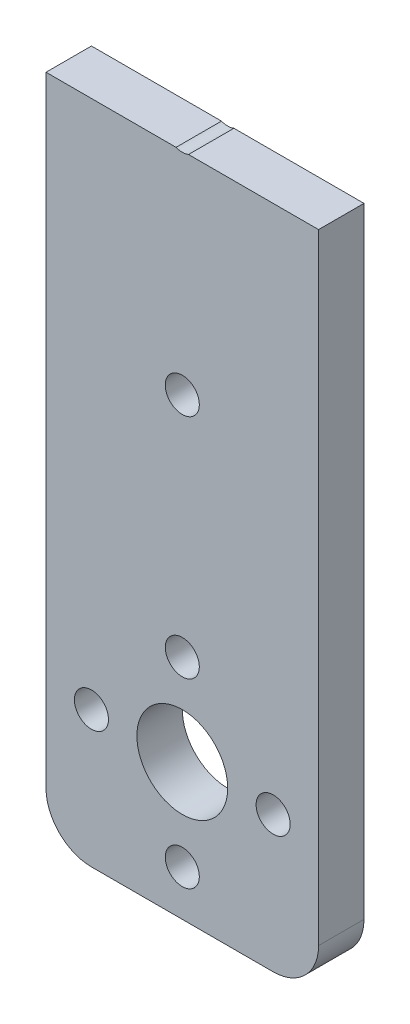
ISO-10303-21;
HEADER;
FILE_DESCRIPTION(('STEP AP214'),'2;1');
FILE_NAME('part.step','',(''),(''),'','','');
FILE_SCHEMA(('AUTOMOTIVE_DESIGN { 1 0 10303 214 1 1 1 1 }'));
ENDSEC;
DATA;
#1=APPLICATION_CONTEXT('core data for automotive mechanical design processes');
#2=APPLICATION_PROTOCOL_DEFINITION('international standard','automotive_design',2000,#1);
#3=PRODUCT_CONTEXT('',#1,'mechanical');
#4=PRODUCT('Part','Part','',(#3));
#5=PRODUCT_RELATED_PRODUCT_CATEGORY('part','',(#4));
#6=PRODUCT_DEFINITION_FORMATION('','',#4);
#7=PRODUCT_DEFINITION_CONTEXT('part definition',#1,'design');
#8=PRODUCT_DEFINITION('design','',#6,#7);
#9=PRODUCT_DEFINITION_SHAPE('','',#8);
#10=(LENGTH_UNIT() NAMED_UNIT(*) SI_UNIT(.MILLI.,.METRE.));
#11=(NAMED_UNIT(*) PLANE_ANGLE_UNIT() SI_UNIT($,.RADIAN.));
#12=(NAMED_UNIT(*) SI_UNIT($,.STERADIAN.) SOLID_ANGLE_UNIT());
#13=UNCERTAINTY_MEASURE_WITH_UNIT(LENGTH_MEASURE(1.E-05),#10,'distance_accuracy_value','');
#14=(GEOMETRIC_REPRESENTATION_CONTEXT(3) GLOBAL_UNCERTAINTY_ASSIGNED_CONTEXT((#13)) GLOBAL_UNIT_ASSIGNED_CONTEXT((#10,
#11,#12)) REPRESENTATION_CONTEXT('',''));
#15=CARTESIAN_POINT('',(0.,0.,0.));
#16=DIRECTION('',(0.,0.,1.));
#17=DIRECTION('',(1.,0.,0.));
#18=AXIS2_PLACEMENT_3D('',#15,#16,#17);
#19=CARTESIAN_POINT('',(-57.2966754660947,34.9503189792664,4.));
#20=DIRECTION('',(1.,0.,0.));
#21=DIRECTION('',(0.,1.,0.));
#22=AXIS2_PLACEMENT_3D('',#19,#20,#21);
#23=PLANE('',#22);
#24=DIRECTION('',(0.,-1.,0.));
#25=VECTOR('',#24,1.);
#26=CARTESIAN_POINT('',(-57.2966754660947,34.9503189792664,4.));
#27=LINE('',#26,#25);
#28=CARTESIAN_POINT('',(-57.2966754660947,13.5536352225967,4.));
#29=VERTEX_POINT('',#28);
#30=CARTESIAN_POINT('',(-57.2966754660947,-41.0496810207336,4.));
#31=VERTEX_POINT('',#30);
#32=EDGE_CURVE('E109',#29,#31,#27,.T.);
#33=ORIENTED_EDGE('',*,*,#32,.F.);
#34=DIRECTION('',(0.,0.,1.));
#35=VECTOR('',#34,1.);
#36=CARTESIAN_POINT('',(-57.2966754660947,13.5536352225967,0.));
#37=LINE('',#36,#35);
#38=CARTESIAN_POINT('',(-57.2966754660947,13.5536352225967,0.));
#39=VERTEX_POINT('',#38);
#40=EDGE_CURVE('E98',#39,#29,#37,.T.);
#41=ORIENTED_EDGE('',*,*,#40,.F.);
#42=DIRECTION('',(0.,-1.,0.));
#43=VECTOR('',#42,1.);
#44=CARTESIAN_POINT('',(-57.2966754660947,34.9503189792664,0.));
#45=LINE('',#44,#43);
#46=CARTESIAN_POINT('',(-57.2966754660947,-41.0496810207336,0.));
#47=VERTEX_POINT('',#46);
#48=EDGE_CURVE('E107',#39,#47,#45,.T.);
#49=ORIENTED_EDGE('',*,*,#48,.T.);
#50=DIRECTION('',(0.,0.,-1.));
#51=VECTOR('',#50,1.);
#52=CARTESIAN_POINT('',(-57.2966754660947,-41.0496810207336,4.));
#53=LINE('',#52,#51);
#54=EDGE_CURVE('E135',#47,#31,#53,.F.);
#55=ORIENTED_EDGE('',*,*,#54,.T.);
#56=EDGE_LOOP('',(#33,#41,#49,#55));
#57=FACE_BOUND('',#56,.T.);
#58=ADVANCED_FACE('F33',(#57),#23,.F.);
#59=CARTESIAN_POINT('',(-57.2966754660947,-45.0496810207336,4.));
#60=DIRECTION('',(0.,1.,0.));
#61=DIRECTION('',(0.,0.,1.));
#62=AXIS2_PLACEMENT_3D('',#59,#60,#61);
#63=PLANE('',#62);
#64=DIRECTION('',(1.,0.,0.));
#65=VECTOR('',#64,1.);
#66=CARTESIAN_POINT('',(-57.2966754660947,-45.0496810207336,4.));
#67=LINE('',#66,#65);
#68=CARTESIAN_POINT('',(-53.2966754660947,-45.0496810207336,4.));
#69=VERTEX_POINT('',#68);
#70=CARTESIAN_POINT('',(-37.2966754660947,-45.0496810207336,4.));
#71=VERTEX_POINT('',#70);
#72=EDGE_CURVE('E120',#69,#71,#67,.T.);
#73=ORIENTED_EDGE('',*,*,#72,.F.);
#74=DIRECTION('',(0.,0.,-1.));
#75=VECTOR('',#74,1.);
#76=CARTESIAN_POINT('',(-53.2966754660947,-45.0496810207336,4.));
#77=LINE('',#76,#75);
#78=CARTESIAN_POINT('',(-53.2966754660947,-45.0496810207336,0.));
#79=VERTEX_POINT('',#78);
#80=EDGE_CURVE('E129',#69,#79,#77,.T.);
#81=ORIENTED_EDGE('',*,*,#80,.T.);
#82=DIRECTION('',(1.,0.,0.));
#83=VECTOR('',#82,1.);
#84=CARTESIAN_POINT('',(-57.2966754660947,-45.0496810207336,0.));
#85=LINE('',#84,#83);
#86=CARTESIAN_POINT('',(-37.2966754660947,-45.0496810207336,0.));
#87=VERTEX_POINT('',#86);
#88=EDGE_CURVE('E118',#79,#87,#85,.T.);
#89=ORIENTED_EDGE('',*,*,#88,.T.);
#90=DIRECTION('',(0.,0.,-1.));
#91=VECTOR('',#90,1.);
#92=CARTESIAN_POINT('',(-37.2966754660947,-45.0496810207336,4.));
#93=LINE('',#92,#91);
#94=EDGE_CURVE('E127',#87,#71,#93,.F.);
#95=ORIENTED_EDGE('',*,*,#94,.T.);
#96=EDGE_LOOP('',(#73,#81,#89,#95));
#97=FACE_BOUND('',#96,.T.);
#98=ADVANCED_FACE('F208',(#97),#63,.F.);
#99=CARTESIAN_POINT('',(-33.2966754660947,34.9503189792664,4.));
#100=DIRECTION('',(1.,0.,0.));
#101=DIRECTION('',(0.,1.,0.));
#102=AXIS2_PLACEMENT_3D('',#99,#100,#101);
#103=PLANE('',#102);
#104=DIRECTION('',(0.,0.,1.));
#105=VECTOR('',#104,1.);
#106=CARTESIAN_POINT('',(-33.2966754660947,13.5536352225967,0.));
#107=LINE('',#106,#105);
#108=CARTESIAN_POINT('',(-33.2966754660947,13.5536352225967,0.));
#109=VERTEX_POINT('',#108);
#110=CARTESIAN_POINT('',(-33.2966754660947,13.5536352225967,4.));
#111=VERTEX_POINT('',#110);
#112=EDGE_CURVE('E110',#109,#111,#107,.T.);
#113=ORIENTED_EDGE('',*,*,#112,.T.);
#114=DIRECTION('',(0.,-1.,0.));
#115=VECTOR('',#114,1.);
#116=CARTESIAN_POINT('',(-33.2966754660947,34.9503189792664,4.));
#117=LINE('',#116,#115);
#118=CARTESIAN_POINT('',(-33.2966754660947,-41.0496810207336,4.));
#119=VERTEX_POINT('',#118);
#120=EDGE_CURVE('E117',#111,#119,#117,.T.);
#121=ORIENTED_EDGE('',*,*,#120,.T.);
#122=DIRECTION('',(0.,0.,-1.));
#123=VECTOR('',#122,1.);
#124=CARTESIAN_POINT('',(-33.2966754660947,-41.0496810207336,0.));
#125=LINE('',#124,#123);
#126=CARTESIAN_POINT('',(-33.2966754660947,-41.0496810207336,0.));
#127=VERTEX_POINT('',#126);
#128=EDGE_CURVE('E142',#119,#127,#125,.T.);
#129=ORIENTED_EDGE('',*,*,#128,.T.);
#130=DIRECTION('',(0.,-1.,0.));
#131=VECTOR('',#130,1.);
#132=CARTESIAN_POINT('',(-33.2966754660947,34.9503189792664,0.));
#133=LINE('',#132,#131);
#134=EDGE_CURVE('E123',#109,#127,#133,.T.);
#135=ORIENTED_EDGE('',*,*,#134,.F.);
#136=EDGE_LOOP('',(#113,#121,#129,#135));
#137=FACE_BOUND('',#136,.T.);
#138=ADVANCED_FACE('F203',(#137),#103,.T.);
#139=CARTESIAN_POINT('',(0.,0.,4.));
#140=DIRECTION('',(0.,0.,-1.));
#141=DIRECTION('',(-1.,0.,0.));
#142=AXIS2_PLACEMENT_3D('',#139,#140,#141);
#143=PLANE('',#142);
#144=CARTESIAN_POINT('',(-45.2966754660948,-5.04968102073364,4.));
#145=DIRECTION('',(0.,0.,1.));
#146=DIRECTION('',(1.,0.,0.));
#147=AXIS2_PLACEMENT_3D('',#144,#145,#146);
#148=CIRCLE('',#147,1.5);
#149=CARTESIAN_POINT('',(-43.7966754660948,-5.04968102073364,4.));
#150=VERTEX_POINT('',#149);
#151=EDGE_CURVE('E164',#150,#150,#148,.T.);
#152=ORIENTED_EDGE('',*,*,#151,.F.);
#153=EDGE_LOOP('',(#152));
#154=FACE_BOUND('',#153,.T.);
#155=ORIENTED_EDGE('',*,*,#120,.F.);
#156=DIRECTION('',(1.,0.,0.));
#157=VECTOR('',#156,1.);
#158=CARTESIAN_POINT('',(-57.2966754660947,13.5536352225967,4.));
#159=LINE('',#158,#157);
#160=CARTESIAN_POINT('',(-44.7496156120979,13.5536352225967,4.));
#161=VERTEX_POINT('',#160);
#162=EDGE_CURVE('E155',#161,#111,#159,.T.);
#163=ORIENTED_EDGE('',*,*,#162,.F.);
#164=CARTESIAN_POINT('',(-45.2966754660948,14.9503189792664,4.));
#165=DIRECTION('',(0.,0.,1.));
#166=DIRECTION('',(1.,0.,0.));
#167=AXIS2_PLACEMENT_3D('',#164,#165,#166);
#168=CIRCLE('',#167,1.5);
#169=CARTESIAN_POINT('',(-45.8437353200918,13.5536352225967,4.));
#170=VERTEX_POINT('',#169);
#171=EDGE_CURVE('E148',#170,#161,#168,.T.);
#172=ORIENTED_EDGE('',*,*,#171,.F.);
#173=EDGE_CURVE('E48',#29,#170,#159,.T.);
#174=ORIENTED_EDGE('',*,*,#173,.F.);
#175=ORIENTED_EDGE('',*,*,#32,.T.);
#176=CARTESIAN_POINT('',(-53.2966754660947,-41.0496810207336,4.));
#177=DIRECTION('',(0.,0.,-1.));
#178=DIRECTION('',(-1.,0.,0.));
#179=AXIS2_PLACEMENT_3D('',#176,#177,#178);
#180=CIRCLE('',#179,4.);
#181=EDGE_CURVE('E140',#31,#69,#180,.F.);
#182=ORIENTED_EDGE('',*,*,#181,.T.);
#183=ORIENTED_EDGE('',*,*,#72,.T.);
#184=CARTESIAN_POINT('',(-37.2966754660947,-41.0496810207336,4.));
#185=DIRECTION('',(0.,0.,-1.));
#186=DIRECTION('',(-1.,0.,0.));
#187=AXIS2_PLACEMENT_3D('',#184,#185,#186);
#188=CIRCLE('',#187,4.);
#189=EDGE_CURVE('E137',#71,#119,#188,.F.);
#190=ORIENTED_EDGE('',*,*,#189,.T.);
#191=EDGE_LOOP('',(#155,#163,#172,#174,#175,#182,#183,#190));
#192=FACE_BOUND('',#191,.T.);
#193=CARTESIAN_POINT('',(-53.2966754660947,-33.0496810207337,4.));
#194=DIRECTION('',(0.,0.,1.));
#195=DIRECTION('',(1.,0.,0.));
#196=AXIS2_PLACEMENT_3D('',#193,#194,#195);
#197=CIRCLE('',#196,1.5);
#198=CARTESIAN_POINT('',(-51.7966754660947,-33.0496810207337,4.));
#199=VERTEX_POINT('',#198);
#200=EDGE_CURVE('E159',#199,#199,#197,.T.);
#201=ORIENTED_EDGE('',*,*,#200,.F.);
#202=EDGE_LOOP('',(#201));
#203=FACE_BOUND('',#202,.T.);
#204=CARTESIAN_POINT('',(-45.2966754660947,-41.0496810207336,4.));
#205=DIRECTION('',(0.,0.,1.));
#206=DIRECTION('',(1.,0.,0.));
#207=AXIS2_PLACEMENT_3D('',#204,#205,#206);
#208=CIRCLE('',#207,1.5);
#209=CARTESIAN_POINT('',(-43.7966754660947,-41.0496810207336,4.));
#210=VERTEX_POINT('',#209);
#211=EDGE_CURVE('E170',#210,#210,#208,.T.);
#212=ORIENTED_EDGE('',*,*,#211,.F.);
#213=EDGE_LOOP('',(#212));
#214=FACE_BOUND('',#213,.T.);
#215=CARTESIAN_POINT('',(-37.2966754660947,-33.0496810207336,4.));
#216=DIRECTION('',(0.,0.,1.));
#217=DIRECTION('',(1.,0.,0.));
#218=AXIS2_PLACEMENT_3D('',#215,#216,#217);
#219=CIRCLE('',#218,1.5);
#220=CARTESIAN_POINT('',(-35.7966754660947,-33.0496810207336,4.));
#221=VERTEX_POINT('',#220);
#222=EDGE_CURVE('E176',#221,#221,#219,.T.);
#223=ORIENTED_EDGE('',*,*,#222,.F.);
#224=EDGE_LOOP('',(#223));
#225=FACE_BOUND('',#224,.T.);
#226=CARTESIAN_POINT('',(-45.2966754660947,-33.0496810207336,4.));
#227=DIRECTION('',(0.,0.,1.));
#228=DIRECTION('',(1.,0.,0.));
#229=AXIS2_PLACEMENT_3D('',#226,#227,#228);
#230=CIRCLE('',#229,4.);
#231=CARTESIAN_POINT('',(-41.2966754660947,-33.0496810207336,4.));
#232=VERTEX_POINT('',#231);
#233=EDGE_CURVE('E182',#232,#232,#230,.T.);
#234=ORIENTED_EDGE('',*,*,#233,.F.);
#235=EDGE_LOOP('',(#234));
#236=FACE_BOUND('',#235,.T.);
#237=CARTESIAN_POINT('',(-45.2966754660947,-25.0496810207336,4.));
#238=DIRECTION('',(0.,0.,1.));
#239=DIRECTION('',(1.,0.,0.));
#240=AXIS2_PLACEMENT_3D('',#237,#238,#239);
#241=CIRCLE('',#240,1.5);
#242=CARTESIAN_POINT('',(-43.7966754660947,-25.0496810207336,4.));
#243=VERTEX_POINT('',#242);
#244=EDGE_CURVE('E185',#243,#243,#241,.T.);
#245=ORIENTED_EDGE('',*,*,#244,.F.);
#246=EDGE_LOOP('',(#245));
#247=FACE_BOUND('',#246,.T.);
#248=ADVANCED_FACE('F153',(#154,#192,#203,#214,#225,#236,#247),#143,.F.);
#249=CARTESIAN_POINT('',(0.,0.,0.));
#250=DIRECTION('',(0.,0.,-1.));
#251=DIRECTION('',(-1.,0.,0.));
#252=AXIS2_PLACEMENT_3D('',#249,#250,#251);
#253=PLANE('',#252);
#254=DIRECTION('',(1.,0.,0.));
#255=VECTOR('',#254,1.);
#256=CARTESIAN_POINT('',(-57.2966754660947,13.5536352225967,0.));
#257=LINE('',#256,#255);
#258=CARTESIAN_POINT('',(-44.7496156120979,13.5536352225967,0.));
#259=VERTEX_POINT('',#258);
#260=EDGE_CURVE('E56',#259,#109,#257,.T.);
#261=ORIENTED_EDGE('',*,*,#260,.T.);
#262=ORIENTED_EDGE('',*,*,#134,.T.);
#263=CARTESIAN_POINT('',(-37.2966754660947,-41.0496810207336,0.));
#264=DIRECTION('',(0.,0.,-1.));
#265=DIRECTION('',(-1.,0.,0.));
#266=AXIS2_PLACEMENT_3D('',#263,#264,#265);
#267=CIRCLE('',#266,4.);
#268=EDGE_CURVE('E132',#127,#87,#267,.T.);
#269=ORIENTED_EDGE('',*,*,#268,.T.);
#270=ORIENTED_EDGE('',*,*,#88,.F.);
#271=CARTESIAN_POINT('',(-53.2966754660947,-41.0496810207336,0.));
#272=DIRECTION('',(0.,0.,-1.));
#273=DIRECTION('',(-1.,0.,0.));
#274=AXIS2_PLACEMENT_3D('',#271,#272,#273);
#275=CIRCLE('',#274,4.);
#276=EDGE_CURVE('E115',#79,#47,#275,.T.);
#277=ORIENTED_EDGE('',*,*,#276,.T.);
#278=ORIENTED_EDGE('',*,*,#48,.F.);
#279=CARTESIAN_POINT('',(-45.8437353200918,13.5536352225967,0.));
#280=VERTEX_POINT('',#279);
#281=EDGE_CURVE('E95',#39,#280,#257,.T.);
#282=ORIENTED_EDGE('',*,*,#281,.T.);
#283=CARTESIAN_POINT('',(-45.2966754660948,14.9503189792664,0.));
#284=DIRECTION('',(0.,0.,1.));
#285=DIRECTION('',(1.,0.,0.));
#286=AXIS2_PLACEMENT_3D('',#283,#284,#285);
#287=CIRCLE('',#286,1.5);
#288=EDGE_CURVE('E149',#280,#259,#287,.T.);
#289=ORIENTED_EDGE('',*,*,#288,.T.);
#290=EDGE_LOOP('',(#261,#262,#269,#270,#277,#278,#282,#289));
#291=FACE_BOUND('',#290,.T.);
#292=CARTESIAN_POINT('',(-45.2966754660948,-5.04968102073364,0.));
#293=DIRECTION('',(0.,0.,1.));
#294=DIRECTION('',(1.,0.,0.));
#295=AXIS2_PLACEMENT_3D('',#292,#293,#294);
#296=CIRCLE('',#295,1.5);
#297=CARTESIAN_POINT('',(-43.7966754660948,-5.04968102073364,0.));
#298=VERTEX_POINT('',#297);
#299=EDGE_CURVE('E161',#298,#298,#296,.T.);
#300=ORIENTED_EDGE('',*,*,#299,.T.);
#301=EDGE_LOOP('',(#300));
#302=FACE_BOUND('',#301,.T.);
#303=CARTESIAN_POINT('',(-53.2966754660947,-33.0496810207337,0.));
#304=DIRECTION('',(0.,0.,1.));
#305=DIRECTION('',(1.,0.,0.));
#306=AXIS2_PLACEMENT_3D('',#303,#304,#305);
#307=CIRCLE('',#306,1.5);
#308=CARTESIAN_POINT('',(-51.7966754660947,-33.0496810207337,0.));
#309=VERTEX_POINT('',#308);
#310=EDGE_CURVE('E156',#309,#309,#307,.T.);
#311=ORIENTED_EDGE('',*,*,#310,.T.);
#312=EDGE_LOOP('',(#311));
#313=FACE_BOUND('',#312,.T.);
#314=CARTESIAN_POINT('',(-45.2966754660947,-41.0496810207336,0.));
#315=DIRECTION('',(0.,0.,1.));
#316=DIRECTION('',(1.,0.,0.));
#317=AXIS2_PLACEMENT_3D('',#314,#315,#316);
#318=CIRCLE('',#317,1.5);
#319=CARTESIAN_POINT('',(-43.7966754660947,-41.0496810207336,0.));
#320=VERTEX_POINT('',#319);
#321=EDGE_CURVE('E168',#320,#320,#318,.T.);
#322=ORIENTED_EDGE('',*,*,#321,.T.);
#323=EDGE_LOOP('',(#322));
#324=FACE_BOUND('',#323,.T.);
#325=CARTESIAN_POINT('',(-37.2966754660947,-33.0496810207336,0.));
#326=DIRECTION('',(0.,0.,1.));
#327=DIRECTION('',(1.,0.,0.));
#328=AXIS2_PLACEMENT_3D('',#325,#326,#327);
#329=CIRCLE('',#328,1.5);
#330=CARTESIAN_POINT('',(-35.7966754660947,-33.0496810207336,0.));
#331=VERTEX_POINT('',#330);
#332=EDGE_CURVE('E173',#331,#331,#329,.T.);
#333=ORIENTED_EDGE('',*,*,#332,.T.);
#334=EDGE_LOOP('',(#333));
#335=FACE_BOUND('',#334,.T.);
#336=CARTESIAN_POINT('',(-45.2966754660947,-33.0496810207336,0.));
#337=DIRECTION('',(0.,0.,1.));
#338=DIRECTION('',(1.,0.,0.));
#339=AXIS2_PLACEMENT_3D('',#336,#337,#338);
#340=CIRCLE('',#339,4.);
#341=CARTESIAN_POINT('',(-41.2966754660947,-33.0496810207336,0.));
#342=VERTEX_POINT('',#341);
#343=EDGE_CURVE('E179',#342,#342,#340,.T.);
#344=ORIENTED_EDGE('',*,*,#343,.T.);
#345=EDGE_LOOP('',(#344));
#346=FACE_BOUND('',#345,.T.);
#347=CARTESIAN_POINT('',(-45.2966754660947,-25.0496810207336,0.));
#348=DIRECTION('',(0.,0.,1.));
#349=DIRECTION('',(1.,0.,0.));
#350=AXIS2_PLACEMENT_3D('',#347,#348,#349);
#351=CIRCLE('',#350,1.5);
#352=CARTESIAN_POINT('',(-43.7966754660947,-25.0496810207336,0.));
#353=VERTEX_POINT('',#352);
#354=EDGE_CURVE('E188',#353,#353,#351,.T.);
#355=ORIENTED_EDGE('',*,*,#354,.T.);
#356=EDGE_LOOP('',(#355));
#357=FACE_BOUND('',#356,.T.);
#358=ADVANCED_FACE('F112',(#291,#302,#313,#324,#335,#346,#357),#253,.T.);
#359=CARTESIAN_POINT('',(-45.2966754660947,-25.0496810207336,0.));
#360=DIRECTION('',(0.,0.,1.));
#361=DIRECTION('',(1.,0.,0.));
#362=AXIS2_PLACEMENT_3D('',#359,#360,#361);
#363=CYLINDRICAL_SURFACE('',#362,1.5);
#364=ORIENTED_EDGE('',*,*,#354,.F.);
#365=EDGE_LOOP('',(#364));
#366=FACE_BOUND('',#365,.T.);
#367=ORIENTED_EDGE('',*,*,#244,.T.);
#368=EDGE_LOOP('',(#367));
#369=FACE_BOUND('',#368,.T.);
#370=ADVANCED_FACE('F238',(#366,#369),#363,.F.);
#371=CARTESIAN_POINT('',(-45.2966754660947,-33.0496810207336,0.));
#372=DIRECTION('',(0.,0.,1.));
#373=DIRECTION('',(1.,0.,0.));
#374=AXIS2_PLACEMENT_3D('',#371,#372,#373);
#375=CYLINDRICAL_SURFACE('',#374,4.);
#376=ORIENTED_EDGE('',*,*,#343,.F.);
#377=EDGE_LOOP('',(#376));
#378=FACE_BOUND('',#377,.T.);
#379=ORIENTED_EDGE('',*,*,#233,.T.);
#380=EDGE_LOOP('',(#379));
#381=FACE_BOUND('',#380,.T.);
#382=ADVANCED_FACE('F243',(#378,#381),#375,.F.);
#383=CARTESIAN_POINT('',(-37.2966754660947,-33.0496810207336,0.));
#384=DIRECTION('',(0.,0.,1.));
#385=DIRECTION('',(1.,0.,0.));
#386=AXIS2_PLACEMENT_3D('',#383,#384,#385);
#387=CYLINDRICAL_SURFACE('',#386,1.5);
#388=ORIENTED_EDGE('',*,*,#332,.F.);
#389=EDGE_LOOP('',(#388));
#390=FACE_BOUND('',#389,.T.);
#391=ORIENTED_EDGE('',*,*,#222,.T.);
#392=EDGE_LOOP('',(#391));
#393=FACE_BOUND('',#392,.T.);
#394=ADVANCED_FACE('F247',(#390,#393),#387,.F.);
#395=CARTESIAN_POINT('',(-45.2966754660947,-41.0496810207336,0.));
#396=DIRECTION('',(0.,0.,1.));
#397=DIRECTION('',(1.,0.,0.));
#398=AXIS2_PLACEMENT_3D('',#395,#396,#397);
#399=CYLINDRICAL_SURFACE('',#398,1.5);
#400=ORIENTED_EDGE('',*,*,#321,.F.);
#401=EDGE_LOOP('',(#400));
#402=FACE_BOUND('',#401,.T.);
#403=ORIENTED_EDGE('',*,*,#211,.T.);
#404=EDGE_LOOP('',(#403));
#405=FACE_BOUND('',#404,.T.);
#406=ADVANCED_FACE('F251',(#402,#405),#399,.F.);
#407=CARTESIAN_POINT('',(-53.2966754660947,-33.0496810207337,0.));
#408=DIRECTION('',(0.,0.,1.));
#409=DIRECTION('',(1.,0.,0.));
#410=AXIS2_PLACEMENT_3D('',#407,#408,#409);
#411=CYLINDRICAL_SURFACE('',#410,1.5);
#412=ORIENTED_EDGE('',*,*,#310,.F.);
#413=EDGE_LOOP('',(#412));
#414=FACE_BOUND('',#413,.T.);
#415=ORIENTED_EDGE('',*,*,#200,.T.);
#416=EDGE_LOOP('',(#415));
#417=FACE_BOUND('',#416,.T.);
#418=ADVANCED_FACE('F218',(#414,#417),#411,.F.);
#419=CARTESIAN_POINT('',(-45.2966754660948,14.9503189792664,0.));
#420=DIRECTION('',(0.,0.,1.));
#421=DIRECTION('',(1.,0.,0.));
#422=AXIS2_PLACEMENT_3D('',#419,#420,#421);
#423=CYLINDRICAL_SURFACE('',#422,1.5);
#424=ORIENTED_EDGE('',*,*,#171,.T.);
#425=DIRECTION('',(0.,0.,1.));
#426=VECTOR('',#425,1.);
#427=CARTESIAN_POINT('',(-44.7496156120979,13.5536352225967,0.));
#428=LINE('',#427,#426);
#429=EDGE_CURVE('E11',#161,#259,#428,.F.);
#430=ORIENTED_EDGE('',*,*,#429,.T.);
#431=ORIENTED_EDGE('',*,*,#288,.F.);
#432=DIRECTION('',(0.,0.,1.));
#433=VECTOR('',#432,1.);
#434=CARTESIAN_POINT('',(-45.8437353200918,13.5536352225967,0.));
#435=LINE('',#434,#433);
#436=EDGE_CURVE('E41',#280,#170,#435,.T.);
#437=ORIENTED_EDGE('',*,*,#436,.T.);
#438=EDGE_LOOP('',(#424,#430,#431,#437));
#439=FACE_BOUND('',#438,.T.);
#440=ADVANCED_FACE('F147',(#439),#423,.F.);
#441=CARTESIAN_POINT('',(-53.2966754660947,-41.0496810207336,4.));
#442=DIRECTION('',(0.,0.,-1.));
#443=DIRECTION('',(-1.,0.,0.));
#444=AXIS2_PLACEMENT_3D('',#441,#442,#443);
#445=CYLINDRICAL_SURFACE('',#444,4.);
#446=ORIENTED_EDGE('',*,*,#181,.F.);
#447=ORIENTED_EDGE('',*,*,#54,.F.);
#448=ORIENTED_EDGE('',*,*,#276,.F.);
#449=ORIENTED_EDGE('',*,*,#80,.F.);
#450=EDGE_LOOP('',(#446,#447,#448,#449));
#451=FACE_BOUND('',#450,.T.);
#452=ADVANCED_FACE('F210',(#451),#445,.T.);
#453=CARTESIAN_POINT('',(-37.2966754660947,-41.0496810207336,4.));
#454=DIRECTION('',(0.,0.,1.));
#455=DIRECTION('',(1.,0.,0.));
#456=AXIS2_PLACEMENT_3D('',#453,#454,#455);
#457=CYLINDRICAL_SURFACE('',#456,4.);
#458=ORIENTED_EDGE('',*,*,#189,.F.);
#459=ORIENTED_EDGE('',*,*,#94,.F.);
#460=ORIENTED_EDGE('',*,*,#268,.F.);
#461=ORIENTED_EDGE('',*,*,#128,.F.);
#462=EDGE_LOOP('',(#458,#459,#460,#461));
#463=FACE_BOUND('',#462,.T.);
#464=ADVANCED_FACE('F35',(#463),#457,.T.);
#465=CARTESIAN_POINT('',(-45.2966754660948,-5.04968102073364,0.));
#466=DIRECTION('',(0.,0.,1.));
#467=DIRECTION('',(1.,0.,0.));
#468=AXIS2_PLACEMENT_3D('',#465,#466,#467);
#469=CYLINDRICAL_SURFACE('',#468,1.5);
#470=ORIENTED_EDGE('',*,*,#299,.F.);
#471=EDGE_LOOP('',(#470));
#472=FACE_BOUND('',#471,.T.);
#473=ORIENTED_EDGE('',*,*,#151,.T.);
#474=EDGE_LOOP('',(#473));
#475=FACE_BOUND('',#474,.T.);
#476=ADVANCED_FACE('F216',(#472,#475),#469,.F.);
#477=CARTESIAN_POINT('',(-57.2966754660947,13.5536352225967,0.));
#478=DIRECTION('',(0.,-1.,0.));
#479=DIRECTION('',(0.,0.,-1.));
#480=AXIS2_PLACEMENT_3D('',#477,#478,#479);
#481=PLANE('',#480);
#482=ORIENTED_EDGE('',*,*,#281,.F.);
#483=ORIENTED_EDGE('',*,*,#40,.T.);
#484=ORIENTED_EDGE('',*,*,#173,.T.);
#485=ORIENTED_EDGE('',*,*,#436,.F.);
#486=EDGE_LOOP('',(#482,#483,#484,#485));
#487=FACE_BOUND('',#486,.T.);
#488=ADVANCED_FACE('F97',(#487),#481,.F.);
#489=ORIENTED_EDGE('',*,*,#162,.T.);
#490=ORIENTED_EDGE('',*,*,#112,.F.);
#491=ORIENTED_EDGE('',*,*,#260,.F.);
#492=ORIENTED_EDGE('',*,*,#429,.F.);
#493=EDGE_LOOP('',(#489,#490,#491,#492));
#494=FACE_BOUND('',#493,.T.);
#495=ADVANCED_FACE('F262',(#494),#481,.F.);
#496=CLOSED_SHELL('',(#58,#98,#138,#248,#358,#370,#382,#394,#406,#418,#440,#452,#464,#476,#488,#495));
#497=MANIFOLD_SOLID_BREP('B2',#496);
#498=ADVANCED_BREP_SHAPE_REPRESENTATION('',(#18,#497),#14);
#499=SHAPE_DEFINITION_REPRESENTATION(#9,#498);
ENDSEC;
END-ISO-10303-21;
